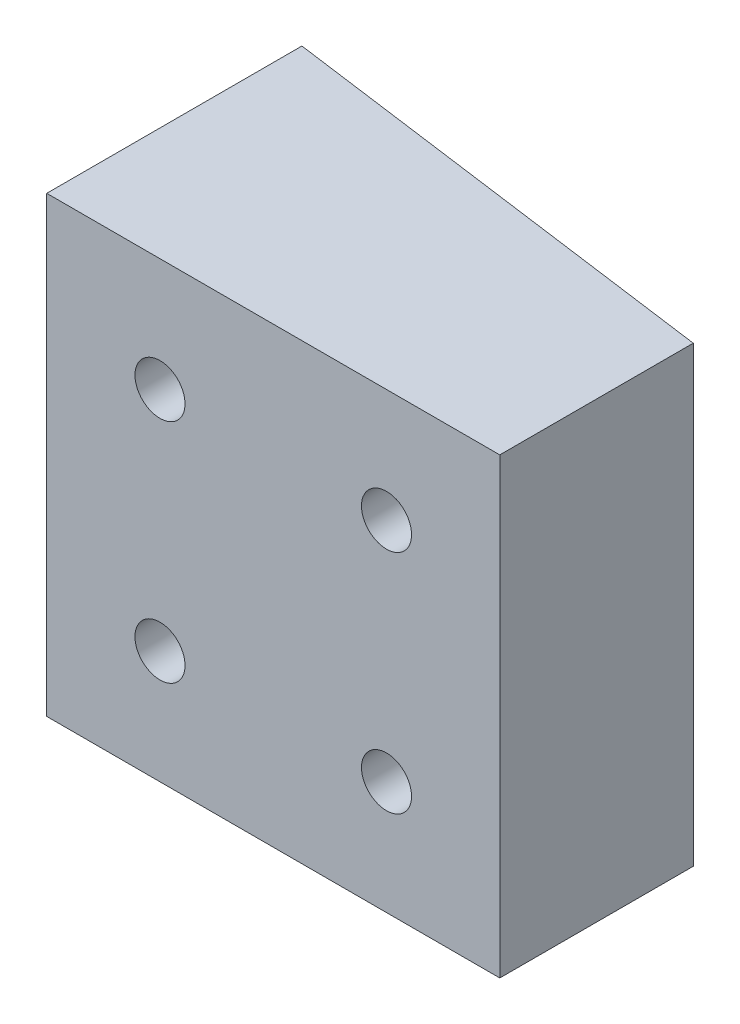
ISO-10303-21;
HEADER;
FILE_DESCRIPTION(('STEP AP214'),'2;1');
FILE_NAME('part.step','',(''),(''),'','','');
FILE_SCHEMA(('AUTOMOTIVE_DESIGN { 1 0 10303 214 1 1 1 1 }'));
ENDSEC;
DATA;
#1=APPLICATION_CONTEXT('core data for automotive mechanical design processes');
#2=APPLICATION_PROTOCOL_DEFINITION('international standard','automotive_design',2000,#1);
#3=PRODUCT_CONTEXT('',#1,'mechanical');
#4=PRODUCT('Part','Part','',(#3));
#5=PRODUCT_RELATED_PRODUCT_CATEGORY('part','',(#4));
#6=PRODUCT_DEFINITION_FORMATION('','',#4);
#7=PRODUCT_DEFINITION_CONTEXT('part definition',#1,'design');
#8=PRODUCT_DEFINITION('design','',#6,#7);
#9=PRODUCT_DEFINITION_SHAPE('','',#8);
#10=(LENGTH_UNIT() NAMED_UNIT(*) SI_UNIT(.MILLI.,.METRE.));
#11=(NAMED_UNIT(*) PLANE_ANGLE_UNIT() SI_UNIT($,.RADIAN.));
#12=(NAMED_UNIT(*) SI_UNIT($,.STERADIAN.) SOLID_ANGLE_UNIT());
#13=UNCERTAINTY_MEASURE_WITH_UNIT(LENGTH_MEASURE(1.E-05),#10,'distance_accuracy_value','');
#14=(GEOMETRIC_REPRESENTATION_CONTEXT(3) GLOBAL_UNCERTAINTY_ASSIGNED_CONTEXT((#13)) GLOBAL_UNIT_ASSIGNED_CONTEXT((#10,
#11,#12)) REPRESENTATION_CONTEXT('',''));
#15=CARTESIAN_POINT('',(0.,0.,0.));
#16=DIRECTION('',(0.,0.,1.));
#17=DIRECTION('',(1.,0.,0.));
#18=AXIS2_PLACEMENT_3D('',#15,#16,#17);
#19=CARTESIAN_POINT('',(0.,50.8,0.));
#20=DIRECTION('',(0.,0.,1.));
#21=DIRECTION('',(1.,0.,0.));
#22=AXIS2_PLACEMENT_3D('',#19,#20,#21);
#23=PLANE('',#22);
#24=CARTESIAN_POINT('',(38.0999999999988,12.7000000000003,1.80411241501588E-13));
#25=DIRECTION('',(0.,0.,-1.));
#26=DIRECTION('',(-1.,0.,0.));
#27=AXIS2_PLACEMENT_3D('',#24,#25,#26);
#28=CIRCLE('',#27,2.8067);
#29=CARTESIAN_POINT('',(35.2932999999988,12.7000000000003,1.80411241501588E-13));
#30=VERTEX_POINT('',#29);
#31=EDGE_CURVE('E133',#30,#30,#28,.T.);
#32=ORIENTED_EDGE('',*,*,#31,.T.);
#33=EDGE_LOOP('',(#32));
#34=FACE_BOUND('',#33,.T.);
#35=CARTESIAN_POINT('',(38.0999999999988,38.1000000000002,1.80411241501588E-13));
#36=DIRECTION('',(0.,0.,-1.));
#37=DIRECTION('',(-1.,0.,0.));
#38=AXIS2_PLACEMENT_3D('',#35,#36,#37);
#39=CIRCLE('',#38,2.8067);
#40=CARTESIAN_POINT('',(35.2932999999988,38.1000000000002,1.80411241501588E-13));
#41=VERTEX_POINT('',#40);
#42=EDGE_CURVE('E122',#41,#41,#39,.T.);
#43=ORIENTED_EDGE('',*,*,#42,.T.);
#44=EDGE_LOOP('',(#43));
#45=FACE_BOUND('',#44,.T.);
#46=CARTESIAN_POINT('',(12.6999999999988,12.7000000000003,1.80411241501588E-13));
#47=DIRECTION('',(0.,0.,-1.));
#48=DIRECTION('',(-1.,0.,0.));
#49=AXIS2_PLACEMENT_3D('',#46,#47,#48);
#50=CIRCLE('',#49,2.80669999999999);
#51=CARTESIAN_POINT('',(9.89329999999878,12.7000000000003,1.80411241501588E-13));
#52=VERTEX_POINT('',#51);
#53=EDGE_CURVE('E121',#52,#52,#50,.T.);
#54=ORIENTED_EDGE('',*,*,#53,.T.);
#55=EDGE_LOOP('',(#54));
#56=FACE_BOUND('',#55,.T.);
#57=CARTESIAN_POINT('',(12.6999999999988,38.1000000000002,1.80411241501588E-13));
#58=DIRECTION('',(0.,0.,-1.));
#59=DIRECTION('',(-1.,0.,0.));
#60=AXIS2_PLACEMENT_3D('',#57,#58,#59);
#61=CIRCLE('',#60,2.80669999999999);
#62=CARTESIAN_POINT('',(9.89329999999878,38.1000000000002,1.80411241501588E-13));
#63=VERTEX_POINT('',#62);
#64=EDGE_CURVE('E138',#63,#63,#61,.T.);
#65=ORIENTED_EDGE('',*,*,#64,.T.);
#66=EDGE_LOOP('',(#65));
#67=FACE_BOUND('',#66,.T.);
#68=DIRECTION('',(-1.,0.,0.));
#69=VECTOR('',#68,1.);
#70=CARTESIAN_POINT('',(0.,0.,0.));
#71=LINE('',#70,#69);
#72=CARTESIAN_POINT('',(50.8,0.,0.));
#73=VERTEX_POINT('',#72);
#74=CARTESIAN_POINT('',(0.,0.,0.));
#75=VERTEX_POINT('',#74);
#76=EDGE_CURVE('E109',#73,#75,#71,.T.);
#77=ORIENTED_EDGE('',*,*,#76,.F.);
#78=DIRECTION('',(0.,-1.,0.));
#79=VECTOR('',#78,1.);
#80=CARTESIAN_POINT('',(50.8,50.8,0.));
#81=LINE('',#80,#79);
#82=CARTESIAN_POINT('',(50.8,50.8,0.));
#83=VERTEX_POINT('',#82);
#84=EDGE_CURVE('E11',#83,#73,#81,.T.);
#85=ORIENTED_EDGE('',*,*,#84,.F.);
#86=DIRECTION('',(-1.,0.,0.));
#87=VECTOR('',#86,1.);
#88=CARTESIAN_POINT('',(0.,50.8,0.));
#89=LINE('',#88,#87);
#90=CARTESIAN_POINT('',(0.,50.8,0.));
#91=VERTEX_POINT('',#90);
#92=EDGE_CURVE('E93',#83,#91,#89,.T.);
#93=ORIENTED_EDGE('',*,*,#92,.T.);
#94=DIRECTION('',(0.,-1.,0.));
#95=VECTOR('',#94,1.);
#96=CARTESIAN_POINT('',(0.,50.8,0.));
#97=LINE('',#96,#95);
#98=EDGE_CURVE('E61',#91,#75,#97,.T.);
#99=ORIENTED_EDGE('',*,*,#98,.T.);
#100=EDGE_LOOP('',(#77,#85,#93,#99));
#101=FACE_BOUND('',#100,.T.);
#102=ADVANCED_FACE('F43',(#34,#45,#56,#67,#101),#23,.T.);
#103=CARTESIAN_POINT('',(50.8,50.8,0.));
#104=DIRECTION('',(-1.,0.,0.));
#105=DIRECTION('',(0.,0.,1.));
#106=AXIS2_PLACEMENT_3D('',#103,#104,#105);
#107=PLANE('',#106);
#108=DIRECTION('',(0.,0.,-1.));
#109=VECTOR('',#108,1.);
#110=CARTESIAN_POINT('',(50.8,0.,0.));
#111=LINE('',#110,#109);
#112=CARTESIAN_POINT('',(50.8,0.,-21.6943744703176));
#113=VERTEX_POINT('',#112);
#114=EDGE_CURVE('E99',#73,#113,#111,.T.);
#115=ORIENTED_EDGE('',*,*,#114,.T.);
#116=DIRECTION('',(0.,-1.,0.));
#117=VECTOR('',#116,1.);
#118=CARTESIAN_POINT('',(50.8,50.8,-21.6943744703176));
#119=LINE('',#118,#117);
#120=CARTESIAN_POINT('',(50.8,50.8,-21.6943744703176));
#121=VERTEX_POINT('',#120);
#122=EDGE_CURVE('E52',#121,#113,#119,.T.);
#123=ORIENTED_EDGE('',*,*,#122,.F.);
#124=DIRECTION('',(0.,0.,-1.));
#125=VECTOR('',#124,1.);
#126=CARTESIAN_POINT('',(50.8,50.8,0.));
#127=LINE('',#126,#125);
#128=EDGE_CURVE('E87',#83,#121,#127,.T.);
#129=ORIENTED_EDGE('',*,*,#128,.F.);
#130=ORIENTED_EDGE('',*,*,#84,.T.);
#131=EDGE_LOOP('',(#115,#123,#129,#130));
#132=FACE_BOUND('',#131,.T.);
#133=ADVANCED_FACE('F97',(#132),#107,.F.);
#134=CARTESIAN_POINT('',(3.82380117930097,50.8,-28.0892612219));
#135=DIRECTION('',(0.134886274213767,0.,-0.990861086645716));
#136=DIRECTION('',(-0.990861086645716,0.,-0.134886274213767));
#137=AXIS2_PLACEMENT_3D('',#134,#135,#136);
#138=PLANE('',#137);
#139=CARTESIAN_POINT('',(38.0999999999988,12.7000000000003,-23.423230013847));
#140=DIRECTION('',(0.134886274213767,0.,-0.990861086645716));
#141=DIRECTION('',(-0.990861086645716,0.,-0.134886274213767));
#142=AXIS2_PLACEMENT_3D('',#139,#140,#141);
#143=ELLIPSE('',#142,2.83258676501395,2.80669999999999);
#144=CARTESIAN_POINT('',(35.2932999999988,12.7000000000003,-23.805307088967));
#145=VERTEX_POINT('',#144);
#146=EDGE_CURVE('E46',#145,#145,#143,.T.);
#147=ORIENTED_EDGE('',*,*,#146,.F.);
#148=EDGE_LOOP('',(#147));
#149=FACE_BOUND('',#148,.T.);
#150=CARTESIAN_POINT('',(38.0999999999988,38.1000000000002,-23.423230013847));
#151=DIRECTION('',(0.134886274213767,0.,-0.990861086645716));
#152=DIRECTION('',(-0.990861086645716,0.,-0.134886274213767));
#153=AXIS2_PLACEMENT_3D('',#150,#151,#152);
#154=ELLIPSE('',#153,2.83258676501395,2.80669999999999);
#155=CARTESIAN_POINT('',(35.2932999999988,38.1000000000002,-23.805307088967));
#156=VERTEX_POINT('',#155);
#157=EDGE_CURVE('E119',#156,#156,#154,.T.);
#158=ORIENTED_EDGE('',*,*,#157,.F.);
#159=EDGE_LOOP('',(#158));
#160=FACE_BOUND('',#159,.T.);
#161=CARTESIAN_POINT('',(12.6999999999988,12.7000000000003,-26.8809411009055));
#162=DIRECTION('',(0.134886274213767,0.,-0.990861086645716));
#163=DIRECTION('',(-0.990861086645716,0.,-0.134886274213767));
#164=AXIS2_PLACEMENT_3D('',#161,#162,#163);
#165=ELLIPSE('',#164,2.83258676501394,2.80669999999999);
#166=CARTESIAN_POINT('',(9.89329999999878,12.7000000000003,-27.2630181760254));
#167=VERTEX_POINT('',#166);
#168=EDGE_CURVE('E126',#167,#167,#165,.T.);
#169=ORIENTED_EDGE('',*,*,#168,.F.);
#170=EDGE_LOOP('',(#169));
#171=FACE_BOUND('',#170,.T.);
#172=CARTESIAN_POINT('',(12.6999999999988,38.1000000000002,-26.8809411009055));
#173=DIRECTION('',(0.134886274213767,0.,-0.990861086645716));
#174=DIRECTION('',(-0.990861086645716,0.,-0.134886274213767));
#175=AXIS2_PLACEMENT_3D('',#172,#173,#174);
#176=ELLIPSE('',#175,2.83258676501394,2.80669999999999);
#177=CARTESIAN_POINT('',(9.89329999999878,38.1000000000002,-27.2630181760254));
#178=VERTEX_POINT('',#177);
#179=EDGE_CURVE('E111',#178,#178,#176,.T.);
#180=ORIENTED_EDGE('',*,*,#179,.F.);
#181=EDGE_LOOP('',(#180));
#182=FACE_BOUND('',#181,.T.);
#183=DIRECTION('',(0.990861086645716,0.,0.134886274213767));
#184=VECTOR('',#183,1.);
#185=CARTESIAN_POINT('',(3.82380117930097,0.,-28.0892612219));
#186=LINE('',#185,#184);
#187=CARTESIAN_POINT('',(0.,0.,-28.6097966444345));
#188=VERTEX_POINT('',#187);
#189=EDGE_CURVE('E113',#188,#113,#186,.T.);
#190=ORIENTED_EDGE('',*,*,#189,.F.);
#191=DIRECTION('',(0.,-1.,0.));
#192=VECTOR('',#191,1.);
#193=CARTESIAN_POINT('',(0.,50.8,-28.6097966444345));
#194=LINE('',#193,#192);
#195=CARTESIAN_POINT('',(0.,50.8,-28.6097966444345));
#196=VERTEX_POINT('',#195);
#197=EDGE_CURVE('E74',#196,#188,#194,.T.);
#198=ORIENTED_EDGE('',*,*,#197,.F.);
#199=DIRECTION('',(0.990861086645716,0.,0.134886274213767));
#200=VECTOR('',#199,1.);
#201=CARTESIAN_POINT('',(3.82380117930097,50.8,-28.0892612219));
#202=LINE('',#201,#200);
#203=EDGE_CURVE('E92',#196,#121,#202,.T.);
#204=ORIENTED_EDGE('',*,*,#203,.T.);
#205=ORIENTED_EDGE('',*,*,#122,.T.);
#206=EDGE_LOOP('',(#190,#198,#204,#205));
#207=FACE_BOUND('',#206,.T.);
#208=ADVANCED_FACE('F103',(#149,#160,#171,#182,#207),#138,.T.);
#209=CARTESIAN_POINT('',(0.,50.8,0.));
#210=DIRECTION('',(-1.,0.,0.));
#211=DIRECTION('',(0.,0.,1.));
#212=AXIS2_PLACEMENT_3D('',#209,#210,#211);
#213=PLANE('',#212);
#214=DIRECTION('',(0.,0.,-1.));
#215=VECTOR('',#214,1.);
#216=CARTESIAN_POINT('',(0.,0.,0.));
#217=LINE('',#216,#215);
#218=EDGE_CURVE('E115',#75,#188,#217,.T.);
#219=ORIENTED_EDGE('',*,*,#218,.F.);
#220=ORIENTED_EDGE('',*,*,#98,.F.);
#221=DIRECTION('',(0.,0.,-1.));
#222=VECTOR('',#221,1.);
#223=CARTESIAN_POINT('',(0.,50.8,0.));
#224=LINE('',#223,#222);
#225=EDGE_CURVE('E104',#91,#196,#224,.T.);
#226=ORIENTED_EDGE('',*,*,#225,.T.);
#227=ORIENTED_EDGE('',*,*,#197,.T.);
#228=EDGE_LOOP('',(#219,#220,#226,#227));
#229=FACE_BOUND('',#228,.T.);
#230=ADVANCED_FACE('F142',(#229),#213,.T.);
#231=CARTESIAN_POINT('',(0.,50.8,0.));
#232=DIRECTION('',(0.,1.,0.));
#233=DIRECTION('',(0.,0.,1.));
#234=AXIS2_PLACEMENT_3D('',#231,#232,#233);
#235=PLANE('',#234);
#236=ORIENTED_EDGE('',*,*,#92,.F.);
#237=ORIENTED_EDGE('',*,*,#128,.T.);
#238=ORIENTED_EDGE('',*,*,#203,.F.);
#239=ORIENTED_EDGE('',*,*,#225,.F.);
#240=EDGE_LOOP('',(#236,#237,#238,#239));
#241=FACE_BOUND('',#240,.T.);
#242=ADVANCED_FACE('F89',(#241),#235,.T.);
#243=CARTESIAN_POINT('',(0.,0.,0.));
#244=DIRECTION('',(0.,1.,0.));
#245=DIRECTION('',(0.,0.,1.));
#246=AXIS2_PLACEMENT_3D('',#243,#244,#245);
#247=PLANE('',#246);
#248=ORIENTED_EDGE('',*,*,#76,.T.);
#249=ORIENTED_EDGE('',*,*,#218,.T.);
#250=ORIENTED_EDGE('',*,*,#189,.T.);
#251=ORIENTED_EDGE('',*,*,#114,.F.);
#252=EDGE_LOOP('',(#248,#249,#250,#251));
#253=FACE_BOUND('',#252,.T.);
#254=ADVANCED_FACE('F149',(#253),#247,.F.);
#255=CARTESIAN_POINT('',(12.6999999999988,38.1000000000002,-35.5600000000005));
#256=DIRECTION('',(0.,0.,-1.));
#257=DIRECTION('',(-1.,0.,0.));
#258=AXIS2_PLACEMENT_3D('',#255,#256,#257);
#259=CYLINDRICAL_SURFACE('',#258,2.80669999999999);
#260=ORIENTED_EDGE('',*,*,#179,.T.);
#261=EDGE_LOOP('',(#260));
#262=FACE_BOUND('',#261,.T.);
#263=ORIENTED_EDGE('',*,*,#64,.F.);
#264=EDGE_LOOP('',(#263));
#265=FACE_BOUND('',#264,.T.);
#266=ADVANCED_FACE('F167',(#262,#265),#259,.F.);
#267=CARTESIAN_POINT('',(12.6999999999988,12.7000000000003,-35.5600000000005));
#268=DIRECTION('',(0.,0.,-1.));
#269=DIRECTION('',(-1.,0.,0.));
#270=AXIS2_PLACEMENT_3D('',#267,#268,#269);
#271=CYLINDRICAL_SURFACE('',#270,2.80669999999999);
#272=ORIENTED_EDGE('',*,*,#168,.T.);
#273=EDGE_LOOP('',(#272));
#274=FACE_BOUND('',#273,.T.);
#275=ORIENTED_EDGE('',*,*,#53,.F.);
#276=EDGE_LOOP('',(#275));
#277=FACE_BOUND('',#276,.T.);
#278=ADVANCED_FACE('F169',(#274,#277),#271,.F.);
#279=CARTESIAN_POINT('',(38.0999999999988,38.1000000000002,-33.0200000000006));
#280=DIRECTION('',(0.,0.,-1.));
#281=DIRECTION('',(-1.,0.,0.));
#282=AXIS2_PLACEMENT_3D('',#279,#280,#281);
#283=CYLINDRICAL_SURFACE('',#282,2.80669999999999);
#284=ORIENTED_EDGE('',*,*,#157,.T.);
#285=EDGE_LOOP('',(#284));
#286=FACE_BOUND('',#285,.T.);
#287=ORIENTED_EDGE('',*,*,#42,.F.);
#288=EDGE_LOOP('',(#287));
#289=FACE_BOUND('',#288,.T.);
#290=ADVANCED_FACE('F175',(#286,#289),#283,.F.);
#291=CARTESIAN_POINT('',(38.0999999999988,12.7000000000003,-33.0200000000006));
#292=DIRECTION('',(0.,0.,-1.));
#293=DIRECTION('',(-1.,0.,0.));
#294=AXIS2_PLACEMENT_3D('',#291,#292,#293);
#295=CYLINDRICAL_SURFACE('',#294,2.80669999999999);
#296=ORIENTED_EDGE('',*,*,#146,.T.);
#297=EDGE_LOOP('',(#296));
#298=FACE_BOUND('',#297,.T.);
#299=ORIENTED_EDGE('',*,*,#31,.F.);
#300=EDGE_LOOP('',(#299));
#301=FACE_BOUND('',#300,.T.);
#302=ADVANCED_FACE('F182',(#298,#301),#295,.F.);
#303=CLOSED_SHELL('',(#102,#133,#208,#230,#242,#254,#266,#278,#290,#302));
#304=MANIFOLD_SOLID_BREP('B2',#303);
#305=ADVANCED_BREP_SHAPE_REPRESENTATION('',(#18,#304),#14);
#306=SHAPE_DEFINITION_REPRESENTATION(#9,#305);
ENDSEC;
END-ISO-10303-21;
